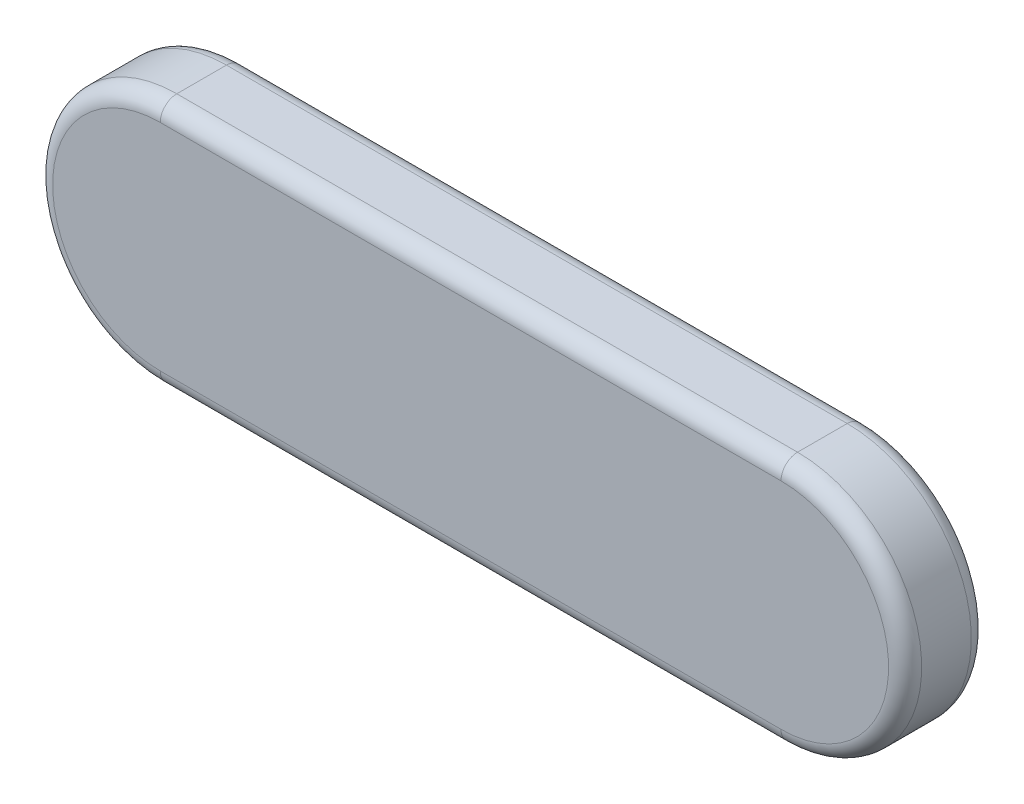
ISO-10303-21;
HEADER;
FILE_DESCRIPTION(('STEP AP214'),'2;1');
FILE_NAME('part.step','',(''),(''),'','','');
FILE_SCHEMA(('AUTOMOTIVE_DESIGN { 1 0 10303 214 1 1 1 1 }'));
ENDSEC;
DATA;
#1=APPLICATION_CONTEXT('core data for automotive mechanical design processes');
#2=APPLICATION_PROTOCOL_DEFINITION('international standard','automotive_design',2000,#1);
#3=PRODUCT_CONTEXT('',#1,'mechanical');
#4=PRODUCT('Part','Part','',(#3));
#5=PRODUCT_RELATED_PRODUCT_CATEGORY('part','',(#4));
#6=PRODUCT_DEFINITION_FORMATION('','',#4);
#7=PRODUCT_DEFINITION_CONTEXT('part definition',#1,'design');
#8=PRODUCT_DEFINITION('design','',#6,#7);
#9=PRODUCT_DEFINITION_SHAPE('','',#8);
#10=(LENGTH_UNIT() NAMED_UNIT(*) SI_UNIT(.MILLI.,.METRE.));
#11=(NAMED_UNIT(*) PLANE_ANGLE_UNIT() SI_UNIT($,.RADIAN.));
#12=(NAMED_UNIT(*) SI_UNIT($,.STERADIAN.) SOLID_ANGLE_UNIT());
#13=UNCERTAINTY_MEASURE_WITH_UNIT(LENGTH_MEASURE(1.E-05),#10,'distance_accuracy_value','');
#14=(GEOMETRIC_REPRESENTATION_CONTEXT(3) GLOBAL_UNCERTAINTY_ASSIGNED_CONTEXT((#13)) GLOBAL_UNIT_ASSIGNED_CONTEXT((#10,
#11,#12)) REPRESENTATION_CONTEXT('',''));
#15=CARTESIAN_POINT('',(0.,0.,0.));
#16=DIRECTION('',(0.,0.,1.));
#17=DIRECTION('',(1.,0.,0.));
#18=AXIS2_PLACEMENT_3D('',#15,#16,#17);
#19=CARTESIAN_POINT('',(-0.0001069239820026,51.999999999905,32.));
#20=DIRECTION('',(1.,0.,0.));
#21=DIRECTION('',(0.,1.,0.));
#22=AXIS2_PLACEMENT_3D('',#19,#20,#21);
#23=CYLINDRICAL_SURFACE('',#22,8.);
#24=CARTESIAN_POINT('',(-9.266745105339E-05,51.999999999917,32.));
#25=DIRECTION('',(0.999999999998412,1.78206636641073E-06,0.));
#26=DIRECTION('',(-1.78206636641073E-06,0.999999999998412,0.));
#27=AXIS2_PLACEMENT_3D('',#24,#25,#26);
#28=CIRCLE('',#27,8.);
#29=CARTESIAN_POINT('',(-0.000106923981985,59.999999999905,32.));
#30=VERTEX_POINT('',#29);
#31=CARTESIAN_POINT('',(-9.2667451053E-05,51.999999999917,40.));
#32=VERTEX_POINT('',#31);
#33=EDGE_CURVE('E10',#30,#32,#28,.T.);
#34=ORIENTED_EDGE('',*,*,#33,.T.);
#35=DIRECTION('',(1.,0.,0.));
#36=VECTOR('',#35,1.);
#37=CARTESIAN_POINT('',(-0.0001069239820026,51.999999999905,40.));
#38=LINE('',#37,#36);
#39=CARTESIAN_POINT('',(300.,51.999999999905,40.));
#40=VERTEX_POINT('',#39);
#41=EDGE_CURVE('E124',#32,#40,#38,.T.);
#42=ORIENTED_EDGE('',*,*,#41,.T.);
#43=CARTESIAN_POINT('',(300.,51.999999999905,32.));
#44=DIRECTION('',(1.,0.,0.));
#45=DIRECTION('',(0.,1.,0.));
#46=AXIS2_PLACEMENT_3D('',#43,#44,#45);
#47=CIRCLE('',#46,8.);
#48=CARTESIAN_POINT('',(300.,59.999999999905,32.));
#49=VERTEX_POINT('',#48);
#50=EDGE_CURVE('E188',#49,#40,#47,.T.);
#51=ORIENTED_EDGE('',*,*,#50,.F.);
#52=DIRECTION('',(1.,0.,0.));
#53=VECTOR('',#52,1.);
#54=CARTESIAN_POINT('',(-0.0001069239820026,59.999999999905,32.));
#55=LINE('',#54,#53);
#56=EDGE_CURVE('E183',#30,#49,#55,.T.);
#57=ORIENTED_EDGE('',*,*,#56,.F.);
#58=EDGE_LOOP('',(#34,#42,#51,#57));
#59=FACE_BOUND('',#58,.T.);
#60=ADVANCED_FACE('F16',(#59),#23,.T.);
#61=CARTESIAN_POINT('',(-0.0001069239820026,51.999999999905,8.));
#62=DIRECTION('',(1.,0.,0.));
#63=DIRECTION('',(0.,1.,0.));
#64=AXIS2_PLACEMENT_3D('',#61,#62,#63);
#65=CYLINDRICAL_SURFACE('',#64,8.);
#66=DIRECTION('',(1.,0.,0.));
#67=VECTOR('',#66,1.);
#68=CARTESIAN_POINT('',(-0.0001069239820026,59.999999999905,8.));
#69=LINE('',#68,#67);
#70=CARTESIAN_POINT('',(-0.000106923981985,59.999999999905,8.));
#71=VERTEX_POINT('',#70);
#72=CARTESIAN_POINT('',(300.,59.999999999905,8.));
#73=VERTEX_POINT('',#72);
#74=EDGE_CURVE('E83',#71,#73,#69,.T.);
#75=ORIENTED_EDGE('',*,*,#74,.T.);
#76=CARTESIAN_POINT('',(300.,51.999999999905,8.));
#77=DIRECTION('',(-1.,0.,0.));
#78=DIRECTION('',(0.,1.,0.));
#79=AXIS2_PLACEMENT_3D('',#76,#77,#78);
#80=CIRCLE('',#79,8.);
#81=CARTESIAN_POINT('',(300.,51.999999999905,0.));
#82=VERTEX_POINT('',#81);
#83=EDGE_CURVE('E19',#73,#82,#80,.T.);
#84=ORIENTED_EDGE('',*,*,#83,.T.);
#85=DIRECTION('',(1.,0.,0.));
#86=VECTOR('',#85,1.);
#87=CARTESIAN_POINT('',(-0.0001069239820026,51.999999999905,0.));
#88=LINE('',#87,#86);
#89=CARTESIAN_POINT('',(-9.2667451053E-05,51.999999999917,0.));
#90=VERTEX_POINT('',#89);
#91=EDGE_CURVE('E154',#90,#82,#88,.T.);
#92=ORIENTED_EDGE('',*,*,#91,.F.);
#93=CARTESIAN_POINT('',(-9.266745105339E-05,51.999999999917,8.));
#94=DIRECTION('',(-0.999999999998412,-1.78206636641073E-06,0.));
#95=DIRECTION('',(-1.78206636641073E-06,0.999999999998412,0.));
#96=AXIS2_PLACEMENT_3D('',#93,#94,#95);
#97=CIRCLE('',#96,8.);
#98=EDGE_CURVE('E151',#71,#90,#97,.T.);
#99=ORIENTED_EDGE('',*,*,#98,.F.);
#100=EDGE_LOOP('',(#75,#84,#92,#99));
#101=FACE_BOUND('',#100,.T.);
#102=ADVANCED_FACE('F244',(#101),#65,.T.);
#103=CARTESIAN_POINT('',(0.,0.,32.));
#104=DIRECTION('',(0.,0.,1.));
#105=DIRECTION('',(-1.78206636666074E-06,-0.999999999998412,0.));
#106=AXIS2_PLACEMENT_3D('',#103,#104,#105);
#107=TOROIDAL_SURFACE('',#106,52.,8.);
#108=CARTESIAN_POINT('',(0.,0.,40.));
#109=DIRECTION('',(0.,0.,-1.));
#110=DIRECTION('',(-1.78206636666074E-06,-0.999999999998412,0.));
#111=AXIS2_PLACEMENT_3D('',#108,#109,#110);
#112=CIRCLE('',#111,52.);
#113=CARTESIAN_POINT('',(-0.000106923982003,-52.,40.));
#114=VERTEX_POINT('',#113);
#115=EDGE_CURVE('E26',#114,#32,#112,.T.);
#116=ORIENTED_EDGE('',*,*,#115,.T.);
#117=ORIENTED_EDGE('',*,*,#33,.F.);
#118=CARTESIAN_POINT('',(0.,0.,32.));
#119=DIRECTION('',(0.,0.,-1.));
#120=DIRECTION('',(-1.78206636666074E-06,-0.999999999998412,0.));
#121=AXIS2_PLACEMENT_3D('',#118,#119,#120);
#122=CIRCLE('',#121,60.);
#123=CARTESIAN_POINT('',(-0.000106923982003,-60.,32.));
#124=VERTEX_POINT('',#123);
#125=EDGE_CURVE('E132',#124,#30,#122,.T.);
#126=ORIENTED_EDGE('',*,*,#125,.F.);
#127=CARTESIAN_POINT('',(-0.0001069239820026,-52.,32.));
#128=DIRECTION('',(-1.,0.,0.));
#129=DIRECTION('',(0.,-1.,0.));
#130=AXIS2_PLACEMENT_3D('',#127,#128,#129);
#131=CIRCLE('',#130,8.);
#132=EDGE_CURVE('E129',#124,#114,#131,.T.);
#133=ORIENTED_EDGE('',*,*,#132,.T.);
#134=EDGE_LOOP('',(#116,#117,#126,#133));
#135=FACE_BOUND('',#134,.T.);
#136=ADVANCED_FACE('F130',(#135),#107,.T.);
#137=CARTESIAN_POINT('',(149.99999328041,4.08815819E-09,40.));
#138=DIRECTION('',(0.,0.,-1.));
#139=DIRECTION('',(0.,-1.,0.));
#140=AXIS2_PLACEMENT_3D('',#137,#138,#139);
#141=PLANE('',#140);
#142=CARTESIAN_POINT('',(300.,0.,40.));
#143=DIRECTION('',(0.,0.,-1.));
#144=DIRECTION('',(0.,1.,0.));
#145=AXIS2_PLACEMENT_3D('',#142,#143,#144);
#146=CIRCLE('',#145,52.);
#147=CARTESIAN_POINT('',(299.99999950821,-52.,40.));
#148=VERTEX_POINT('',#147);
#149=EDGE_CURVE('E112',#40,#148,#146,.T.);
#150=ORIENTED_EDGE('',*,*,#149,.F.);
#151=ORIENTED_EDGE('',*,*,#41,.F.);
#152=ORIENTED_EDGE('',*,*,#115,.F.);
#153=DIRECTION('',(-1.,0.,0.));
#154=VECTOR('',#153,1.);
#155=CARTESIAN_POINT('',(299.99999950821,-52.,40.));
#156=LINE('',#155,#154);
#157=EDGE_CURVE('E122',#148,#114,#156,.T.);
#158=ORIENTED_EDGE('',*,*,#157,.F.);
#159=EDGE_LOOP('',(#150,#151,#152,#158));
#160=FACE_BOUND('',#159,.T.);
#161=ADVANCED_FACE('F120',(#160),#141,.F.);
#162=CARTESIAN_POINT('',(0.,0.,8.));
#163=DIRECTION('',(0.,0.,-1.));
#164=DIRECTION('',(-1.78206636666074E-06,-0.999999999998412,0.));
#165=AXIS2_PLACEMENT_3D('',#162,#163,#164);
#166=TOROIDAL_SURFACE('',#165,52.,8.);
#167=CARTESIAN_POINT('',(-0.0001069239820026,-52.,8.));
#168=DIRECTION('',(1.,0.,0.));
#169=DIRECTION('',(0.,-1.,0.));
#170=AXIS2_PLACEMENT_3D('',#167,#168,#169);
#171=CIRCLE('',#170,8.);
#172=CARTESIAN_POINT('',(-0.000106923982003,-60.,8.));
#173=VERTEX_POINT('',#172);
#174=CARTESIAN_POINT('',(-0.000106923982003,-52.,0.));
#175=VERTEX_POINT('',#174);
#176=EDGE_CURVE('E162',#173,#175,#171,.T.);
#177=ORIENTED_EDGE('',*,*,#176,.F.);
#178=CARTESIAN_POINT('',(0.,0.,8.));
#179=DIRECTION('',(0.,0.,-1.));
#180=DIRECTION('',(-1.78206636666074E-06,-0.999999999998412,0.));
#181=AXIS2_PLACEMENT_3D('',#178,#179,#180);
#182=CIRCLE('',#181,60.);
#183=EDGE_CURVE('E96',#173,#71,#182,.T.);
#184=ORIENTED_EDGE('',*,*,#183,.T.);
#185=ORIENTED_EDGE('',*,*,#98,.T.);
#186=CARTESIAN_POINT('',(0.,0.,0.));
#187=DIRECTION('',(0.,0.,-1.));
#188=DIRECTION('',(-1.78206636666074E-06,-0.999999999998412,0.));
#189=AXIS2_PLACEMENT_3D('',#186,#187,#188);
#190=CIRCLE('',#189,52.);
#191=EDGE_CURVE('E167',#175,#90,#190,.T.);
#192=ORIENTED_EDGE('',*,*,#191,.F.);
#193=EDGE_LOOP('',(#177,#184,#185,#192));
#194=FACE_BOUND('',#193,.T.);
#195=ADVANCED_FACE('F254',(#194),#166,.T.);
#196=CARTESIAN_POINT('',(149.99999328041,4.08815819E-09,0.));
#197=DIRECTION('',(0.,0.,-1.));
#198=DIRECTION('',(0.,-1.,0.));
#199=AXIS2_PLACEMENT_3D('',#196,#197,#198);
#200=PLANE('',#199);
#201=DIRECTION('',(-1.,0.,0.));
#202=VECTOR('',#201,1.);
#203=CARTESIAN_POINT('',(299.99999950821,-52.,0.));
#204=LINE('',#203,#202);
#205=CARTESIAN_POINT('',(299.99999950821,-52.,0.));
#206=VERTEX_POINT('',#205);
#207=EDGE_CURVE('E193',#206,#175,#204,.T.);
#208=ORIENTED_EDGE('',*,*,#207,.T.);
#209=ORIENTED_EDGE('',*,*,#191,.T.);
#210=ORIENTED_EDGE('',*,*,#91,.T.);
#211=CARTESIAN_POINT('',(300.,0.,0.));
#212=DIRECTION('',(0.,0.,-1.));
#213=DIRECTION('',(0.,1.,0.));
#214=AXIS2_PLACEMENT_3D('',#211,#212,#213);
#215=CIRCLE('',#214,52.);
#216=EDGE_CURVE('E105',#82,#206,#215,.T.);
#217=ORIENTED_EDGE('',*,*,#216,.T.);
#218=EDGE_LOOP('',(#208,#209,#210,#217));
#219=FACE_BOUND('',#218,.T.);
#220=ADVANCED_FACE('F258',(#219),#200,.T.);
#221=CARTESIAN_POINT('',(-0.000106923981998,59.999999999905,0.));
#222=DIRECTION('',(0.,1.,0.));
#223=DIRECTION('',(1.,0.,0.));
#224=AXIS2_PLACEMENT_3D('',#221,#222,#223);
#225=PLANE('',#224);
#226=DIRECTION('',(0.,0.,1.));
#227=VECTOR('',#226,1.);
#228=CARTESIAN_POINT('',(-0.000106923981998,59.999999999905,0.));
#229=LINE('',#228,#227);
#230=EDGE_CURVE('E171',#71,#30,#229,.T.);
#231=ORIENTED_EDGE('',*,*,#230,.T.);
#232=ORIENTED_EDGE('',*,*,#56,.T.);
#233=DIRECTION('',(0.,0.,1.));
#234=VECTOR('',#233,1.);
#235=CARTESIAN_POINT('',(300.,59.999999999952,0.));
#236=LINE('',#235,#234);
#237=EDGE_CURVE('E163',#73,#49,#236,.T.);
#238=ORIENTED_EDGE('',*,*,#237,.F.);
#239=ORIENTED_EDGE('',*,*,#74,.F.);
#240=EDGE_LOOP('',(#231,#232,#238,#239));
#241=FACE_BOUND('',#240,.T.);
#242=ADVANCED_FACE('F273',(#241),#225,.T.);
#243=CARTESIAN_POINT('',(300.,0.,32.));
#244=DIRECTION('',(0.,0.,1.));
#245=DIRECTION('',(0.,1.,0.));
#246=AXIS2_PLACEMENT_3D('',#243,#244,#245);
#247=TOROIDAL_SURFACE('',#246,52.,8.);
#248=ORIENTED_EDGE('',*,*,#149,.T.);
#249=CARTESIAN_POINT('',(299.99999950821,-52.,32.));
#250=DIRECTION('',(-1.,0.,0.));
#251=DIRECTION('',(0.,-1.,0.));
#252=AXIS2_PLACEMENT_3D('',#249,#250,#251);
#253=CIRCLE('',#252,8.);
#254=CARTESIAN_POINT('',(299.99999950821,-60.,32.));
#255=VERTEX_POINT('',#254);
#256=EDGE_CURVE('E138',#255,#148,#253,.T.);
#257=ORIENTED_EDGE('',*,*,#256,.F.);
#258=CARTESIAN_POINT('',(300.,0.,32.));
#259=DIRECTION('',(0.,0.,-1.));
#260=DIRECTION('',(0.,1.,0.));
#261=AXIS2_PLACEMENT_3D('',#258,#259,#260);
#262=CIRCLE('',#261,60.);
#263=EDGE_CURVE('E159',#49,#255,#262,.T.);
#264=ORIENTED_EDGE('',*,*,#263,.F.);
#265=ORIENTED_EDGE('',*,*,#50,.T.);
#266=EDGE_LOOP('',(#248,#257,#264,#265));
#267=FACE_BOUND('',#266,.T.);
#268=ADVANCED_FACE('F239',(#267),#247,.T.);
#269=CARTESIAN_POINT('',(300.,0.,8.));
#270=DIRECTION('',(0.,0.,-1.));
#271=DIRECTION('',(0.,1.,0.));
#272=AXIS2_PLACEMENT_3D('',#269,#270,#271);
#273=TOROIDAL_SURFACE('',#272,52.,8.);
#274=ORIENTED_EDGE('',*,*,#83,.F.);
#275=CARTESIAN_POINT('',(300.,0.,8.));
#276=DIRECTION('',(0.,0.,-1.));
#277=DIRECTION('',(0.,1.,0.));
#278=AXIS2_PLACEMENT_3D('',#275,#276,#277);
#279=CIRCLE('',#278,60.);
#280=CARTESIAN_POINT('',(299.99999950821,-60.,8.));
#281=VERTEX_POINT('',#280);
#282=EDGE_CURVE('E205',#73,#281,#279,.T.);
#283=ORIENTED_EDGE('',*,*,#282,.T.);
#284=CARTESIAN_POINT('',(299.99999950821,-52.,8.));
#285=DIRECTION('',(1.,0.,0.));
#286=DIRECTION('',(0.,-1.,0.));
#287=AXIS2_PLACEMENT_3D('',#284,#285,#286);
#288=CIRCLE('',#287,8.);
#289=EDGE_CURVE('E143',#281,#206,#288,.T.);
#290=ORIENTED_EDGE('',*,*,#289,.T.);
#291=ORIENTED_EDGE('',*,*,#216,.F.);
#292=EDGE_LOOP('',(#274,#283,#290,#291));
#293=FACE_BOUND('',#292,.T.);
#294=ADVANCED_FACE('F231',(#293),#273,.T.);
#295=CARTESIAN_POINT('',(0.,0.,0.));
#296=DIRECTION('',(0.,0.,-1.));
#297=DIRECTION('',(1.,0.,0.));
#298=AXIS2_PLACEMENT_3D('',#295,#296,#297);
#299=CYLINDRICAL_SURFACE('',#298,60.);
#300=ORIENTED_EDGE('',*,*,#183,.F.);
#301=DIRECTION('',(0.,0.,1.));
#302=VECTOR('',#301,1.);
#303=CARTESIAN_POINT('',(-0.000106923982001,-59.99999999995,0.));
#304=LINE('',#303,#302);
#305=EDGE_CURVE('E187',#173,#124,#304,.T.);
#306=ORIENTED_EDGE('',*,*,#305,.T.);
#307=ORIENTED_EDGE('',*,*,#125,.T.);
#308=ORIENTED_EDGE('',*,*,#230,.F.);
#309=EDGE_LOOP('',(#300,#306,#307,#308));
#310=FACE_BOUND('',#309,.T.);
#311=ADVANCED_FACE('F229',(#310),#299,.T.);
#312=CARTESIAN_POINT('',(299.99999950821,-52.,32.));
#313=DIRECTION('',(-1.,0.,0.));
#314=DIRECTION('',(0.,-1.,0.));
#315=AXIS2_PLACEMENT_3D('',#312,#313,#314);
#316=CYLINDRICAL_SURFACE('',#315,8.);
#317=ORIENTED_EDGE('',*,*,#256,.T.);
#318=ORIENTED_EDGE('',*,*,#157,.T.);
#319=ORIENTED_EDGE('',*,*,#132,.F.);
#320=DIRECTION('',(-1.,0.,0.));
#321=VECTOR('',#320,1.);
#322=CARTESIAN_POINT('',(299.99999950821,-60.,32.));
#323=LINE('',#322,#321);
#324=EDGE_CURVE('E150',#255,#124,#323,.T.);
#325=ORIENTED_EDGE('',*,*,#324,.F.);
#326=EDGE_LOOP('',(#317,#318,#319,#325));
#327=FACE_BOUND('',#326,.T.);
#328=ADVANCED_FACE('F137',(#327),#316,.T.);
#329=CARTESIAN_POINT('',(299.99999950821,-52.,8.));
#330=DIRECTION('',(-1.,0.,0.));
#331=DIRECTION('',(0.,-1.,0.));
#332=AXIS2_PLACEMENT_3D('',#329,#330,#331);
#333=CYLINDRICAL_SURFACE('',#332,8.);
#334=DIRECTION('',(-1.,0.,0.));
#335=VECTOR('',#334,1.);
#336=CARTESIAN_POINT('',(299.99999950821,-60.,8.));
#337=LINE('',#336,#335);
#338=EDGE_CURVE('E198',#281,#173,#337,.T.);
#339=ORIENTED_EDGE('',*,*,#338,.T.);
#340=ORIENTED_EDGE('',*,*,#176,.T.);
#341=ORIENTED_EDGE('',*,*,#207,.F.);
#342=ORIENTED_EDGE('',*,*,#289,.F.);
#343=EDGE_LOOP('',(#339,#340,#341,#342));
#344=FACE_BOUND('',#343,.T.);
#345=ADVANCED_FACE('F224',(#344),#333,.T.);
#346=CARTESIAN_POINT('',(300.,0.,0.));
#347=DIRECTION('',(0.,0.,-1.));
#348=DIRECTION('',(1.,0.,0.));
#349=AXIS2_PLACEMENT_3D('',#346,#347,#348);
#350=CYLINDRICAL_SURFACE('',#349,60.);
#351=ORIENTED_EDGE('',*,*,#282,.F.);
#352=ORIENTED_EDGE('',*,*,#237,.T.);
#353=ORIENTED_EDGE('',*,*,#263,.T.);
#354=DIRECTION('',(0.,0.,1.));
#355=VECTOR('',#354,1.);
#356=CARTESIAN_POINT('',(299.99999950821,-60.,0.));
#357=LINE('',#356,#355);
#358=EDGE_CURVE('E146',#281,#255,#357,.T.);
#359=ORIENTED_EDGE('',*,*,#358,.F.);
#360=EDGE_LOOP('',(#351,#352,#353,#359));
#361=FACE_BOUND('',#360,.T.);
#362=ADVANCED_FACE('F261',(#361),#350,.T.);
#363=CARTESIAN_POINT('',(299.99999950821,-60.,0.));
#364=DIRECTION('',(0.,-1.,0.));
#365=DIRECTION('',(0.,0.,-1.));
#366=AXIS2_PLACEMENT_3D('',#363,#364,#365);
#367=PLANE('',#366);
#368=ORIENTED_EDGE('',*,*,#358,.T.);
#369=ORIENTED_EDGE('',*,*,#324,.T.);
#370=ORIENTED_EDGE('',*,*,#305,.F.);
#371=ORIENTED_EDGE('',*,*,#338,.F.);
#372=EDGE_LOOP('',(#368,#369,#370,#371));
#373=FACE_BOUND('',#372,.T.);
#374=ADVANCED_FACE('F228',(#373),#367,.T.);
#375=CLOSED_SHELL('',(#60,#102,#136,#161,#195,#220,#242,#268,#294,#311,#328,#345,#362,#374));
#376=MANIFOLD_SOLID_BREP('B1',#375);
#377=ADVANCED_BREP_SHAPE_REPRESENTATION('',(#18,#376),#14);
#378=SHAPE_DEFINITION_REPRESENTATION(#9,#377);
ENDSEC;
END-ISO-10303-21;
